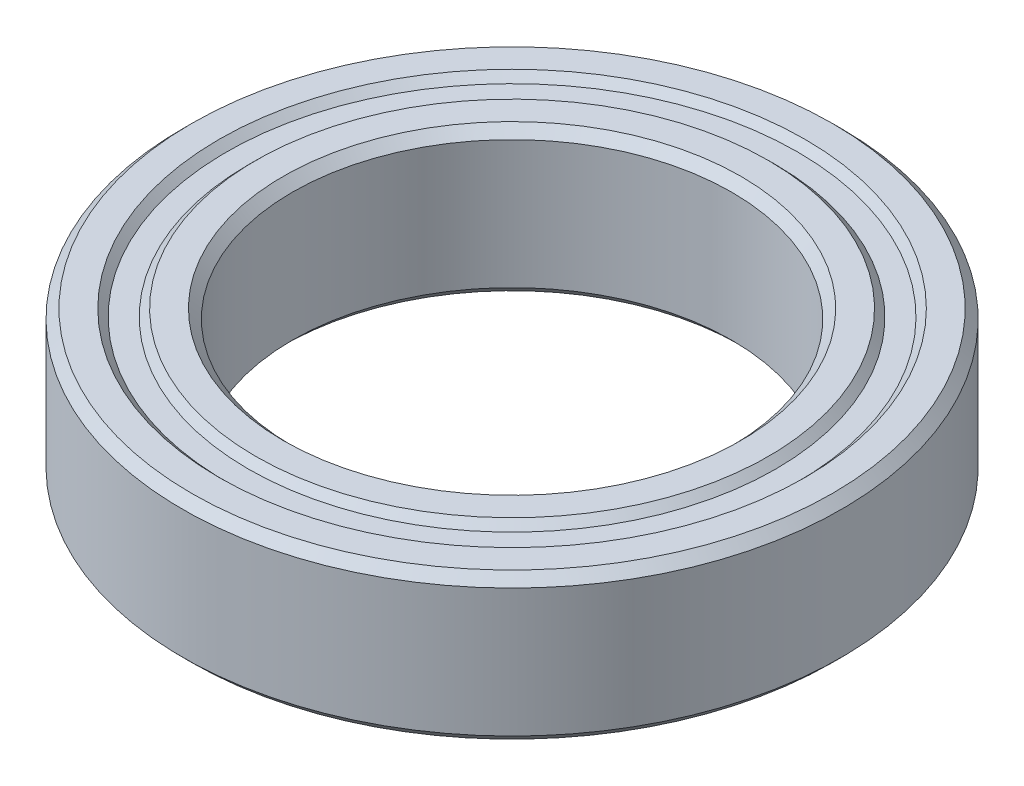
ISO-10303-21;
HEADER;
FILE_DESCRIPTION(('STEP AP214'),'2;1');
FILE_NAME('part.step','',(''),(''),'','','');
FILE_SCHEMA(('AUTOMOTIVE_DESIGN { 1 0 10303 214 1 1 1 1 }'));
ENDSEC;
DATA;
#1=APPLICATION_CONTEXT('core data for automotive mechanical design processes');
#2=APPLICATION_PROTOCOL_DEFINITION('international standard','automotive_design',2000,#1);
#3=PRODUCT_CONTEXT('',#1,'mechanical');
#4=PRODUCT('Part','Part','',(#3));
#5=PRODUCT_RELATED_PRODUCT_CATEGORY('part','',(#4));
#6=PRODUCT_DEFINITION_FORMATION('','',#4);
#7=PRODUCT_DEFINITION_CONTEXT('part definition',#1,'design');
#8=PRODUCT_DEFINITION('design','',#6,#7);
#9=PRODUCT_DEFINITION_SHAPE('','',#8);
#10=(LENGTH_UNIT() NAMED_UNIT(*) SI_UNIT(.MILLI.,.METRE.));
#11=(NAMED_UNIT(*) PLANE_ANGLE_UNIT() SI_UNIT($,.RADIAN.));
#12=(NAMED_UNIT(*) SI_UNIT($,.STERADIAN.) SOLID_ANGLE_UNIT());
#13=UNCERTAINTY_MEASURE_WITH_UNIT(LENGTH_MEASURE(1.E-05),#10,'distance_accuracy_value','');
#14=(GEOMETRIC_REPRESENTATION_CONTEXT(3) GLOBAL_UNCERTAINTY_ASSIGNED_CONTEXT((#13)) GLOBAL_UNIT_ASSIGNED_CONTEXT((#10,
#11,#12)) REPRESENTATION_CONTEXT('',''));
#15=CARTESIAN_POINT('',(0.,0.,0.));
#16=DIRECTION('',(0.,0.,1.));
#17=DIRECTION('',(1.,0.,0.));
#18=AXIS2_PLACEMENT_3D('',#15,#16,#17);
#19=CARTESIAN_POINT('',(0.,2.,0.));
#20=DIRECTION('',(0.,1.,0.));
#21=DIRECTION('',(0.,0.,1.));
#22=AXIS2_PLACEMENT_3D('',#19,#20,#21);
#23=CONICAL_SURFACE('',#22,6.25,0.785398163397447);
#24=CARTESIAN_POINT('',(0.,1.75,0.));
#25=DIRECTION('',(0.,-1.,0.));
#26=DIRECTION('',(0.,0.,-1.));
#27=AXIS2_PLACEMENT_3D('',#24,#25,#26);
#28=CIRCLE('',#27,6.);
#29=CARTESIAN_POINT('',(0.,1.75,-6.));
#30=VERTEX_POINT('',#29);
#31=EDGE_CURVE('E10',#30,#30,#28,.T.);
#32=ORIENTED_EDGE('',*,*,#31,.T.);
#33=EDGE_LOOP('',(#32));
#34=FACE_BOUND('',#33,.T.);
#35=CARTESIAN_POINT('',(0.,2.,0.));
#36=DIRECTION('',(0.,-1.,0.));
#37=DIRECTION('',(0.,0.,-1.));
#38=AXIS2_PLACEMENT_3D('',#35,#36,#37);
#39=CIRCLE('',#38,6.25);
#40=CARTESIAN_POINT('',(0.,2.,-6.25));
#41=VERTEX_POINT('',#40);
#42=EDGE_CURVE('E86',#41,#41,#39,.T.);
#43=ORIENTED_EDGE('',*,*,#42,.F.);
#44=EDGE_LOOP('',(#43));
#45=FACE_BOUND('',#44,.T.);
#46=ADVANCED_FACE('F34',(#34,#45),#23,.F.);
#47=CARTESIAN_POINT('',(0.,-1.34942197217015,0.));
#48=DIRECTION('',(0.,-1.,0.));
#49=DIRECTION('',(0.,0.,-1.));
#50=AXIS2_PLACEMENT_3D('',#47,#48,#49);
#51=CYLINDRICAL_SURFACE('',#50,6.);
#52=CARTESIAN_POINT('',(0.,-1.75,0.));
#53=DIRECTION('',(0.,-1.,0.));
#54=DIRECTION('',(0.,0.,-1.));
#55=AXIS2_PLACEMENT_3D('',#52,#53,#54);
#56=CIRCLE('',#55,6.);
#57=CARTESIAN_POINT('',(0.,-1.75,-6.));
#58=VERTEX_POINT('',#57);
#59=EDGE_CURVE('E40',#58,#58,#56,.T.);
#60=ORIENTED_EDGE('',*,*,#59,.T.);
#61=EDGE_LOOP('',(#60));
#62=FACE_BOUND('',#61,.T.);
#63=ORIENTED_EDGE('',*,*,#31,.F.);
#64=EDGE_LOOP('',(#63));
#65=FACE_BOUND('',#64,.T.);
#66=ADVANCED_FACE('F94',(#62,#65),#51,.F.);
#67=CARTESIAN_POINT('',(0.,-1.75,0.));
#68=DIRECTION('',(0.,-1.,0.));
#69=DIRECTION('',(0.,0.,-1.));
#70=AXIS2_PLACEMENT_3D('',#67,#68,#69);
#71=CONICAL_SURFACE('',#70,6.,0.785398163397447);
#72=CARTESIAN_POINT('',(0.,-2.,0.));
#73=DIRECTION('',(0.,-1.,0.));
#74=DIRECTION('',(0.,0.,-1.));
#75=AXIS2_PLACEMENT_3D('',#72,#73,#74);
#76=CIRCLE('',#75,6.25);
#77=CARTESIAN_POINT('',(0.,-2.,-6.25));
#78=VERTEX_POINT('',#77);
#79=EDGE_CURVE('E44',#78,#78,#76,.T.);
#80=ORIENTED_EDGE('',*,*,#79,.T.);
#81=EDGE_LOOP('',(#80));
#82=FACE_BOUND('',#81,.T.);
#83=ORIENTED_EDGE('',*,*,#59,.F.);
#84=EDGE_LOOP('',(#83));
#85=FACE_BOUND('',#84,.T.);
#86=ADVANCED_FACE('F98',(#82,#85),#71,.F.);
#87=CARTESIAN_POINT('',(6.25,-2.,0.));
#88=DIRECTION('',(0.,-1.,0.));
#89=DIRECTION('',(0.,0.,-1.));
#90=AXIS2_PLACEMENT_3D('',#87,#88,#89);
#91=PLANE('',#90);
#92=CARTESIAN_POINT('',(0.,-2.,0.));
#93=DIRECTION('',(0.,-1.,0.));
#94=DIRECTION('',(0.,0.,-1.));
#95=AXIS2_PLACEMENT_3D('',#92,#93,#94);
#96=CIRCLE('',#95,7.);
#97=CARTESIAN_POINT('',(0.,-2.,-7.));
#98=VERTEX_POINT('',#97);
#99=EDGE_CURVE('E48',#98,#98,#96,.T.);
#100=ORIENTED_EDGE('',*,*,#99,.T.);
#101=EDGE_LOOP('',(#100));
#102=FACE_BOUND('',#101,.T.);
#103=ORIENTED_EDGE('',*,*,#79,.F.);
#104=EDGE_LOOP('',(#103));
#105=FACE_BOUND('',#104,.T.);
#106=ADVANCED_FACE('F102',(#102,#105),#91,.T.);
#107=CARTESIAN_POINT('',(0.,-2.,0.));
#108=DIRECTION('',(0.,1.,0.));
#109=DIRECTION('',(0.,0.,1.));
#110=AXIS2_PLACEMENT_3D('',#107,#108,#109);
#111=CONICAL_SURFACE('',#110,7.,0.78539816339745);
#112=CARTESIAN_POINT('',(0.,-1.8,0.));
#113=DIRECTION('',(0.,-1.,0.));
#114=DIRECTION('',(0.,0.,-1.));
#115=AXIS2_PLACEMENT_3D('',#112,#113,#114);
#116=CIRCLE('',#115,7.2);
#117=CARTESIAN_POINT('',(0.,-1.8,-7.2));
#118=VERTEX_POINT('',#117);
#119=EDGE_CURVE('E53',#118,#118,#116,.T.);
#120=ORIENTED_EDGE('',*,*,#119,.T.);
#121=EDGE_LOOP('',(#120));
#122=FACE_BOUND('',#121,.T.);
#123=ORIENTED_EDGE('',*,*,#99,.F.);
#124=EDGE_LOOP('',(#123));
#125=FACE_BOUND('',#124,.T.);
#126=ADVANCED_FACE('F109',(#122,#125),#111,.T.);
#127=CARTESIAN_POINT('',(7.2,-1.8,0.));
#128=DIRECTION('',(0.,-1.,0.));
#129=DIRECTION('',(0.,0.,-1.));
#130=AXIS2_PLACEMENT_3D('',#127,#128,#129);
#131=PLANE('',#130);
#132=CARTESIAN_POINT('',(0.,-1.8,0.));
#133=DIRECTION('',(0.,-1.,0.));
#134=DIRECTION('',(0.,0.,-1.));
#135=AXIS2_PLACEMENT_3D('',#132,#133,#134);
#136=CIRCLE('',#135,7.8);
#137=CARTESIAN_POINT('',(0.,-1.8,-7.8));
#138=VERTEX_POINT('',#137);
#139=EDGE_CURVE('E56',#138,#138,#136,.T.);
#140=ORIENTED_EDGE('',*,*,#139,.T.);
#141=EDGE_LOOP('',(#140));
#142=FACE_BOUND('',#141,.T.);
#143=ORIENTED_EDGE('',*,*,#119,.F.);
#144=EDGE_LOOP('',(#143));
#145=FACE_BOUND('',#144,.T.);
#146=ADVANCED_FACE('F113',(#142,#145),#131,.T.);
#147=CARTESIAN_POINT('',(0.,-1.8,0.));
#148=DIRECTION('',(0.,-1.,0.));
#149=DIRECTION('',(0.,0.,-1.));
#150=AXIS2_PLACEMENT_3D('',#147,#148,#149);
#151=CONICAL_SURFACE('',#150,7.8,0.78539816339745);
#152=CARTESIAN_POINT('',(0.,-2.,0.));
#153=DIRECTION('',(0.,-1.,0.));
#154=DIRECTION('',(0.,0.,-1.));
#155=AXIS2_PLACEMENT_3D('',#152,#153,#154);
#156=CIRCLE('',#155,8.);
#157=CARTESIAN_POINT('',(0.,-2.,-8.));
#158=VERTEX_POINT('',#157);
#159=EDGE_CURVE('E59',#158,#158,#156,.T.);
#160=ORIENTED_EDGE('',*,*,#159,.T.);
#161=EDGE_LOOP('',(#160));
#162=FACE_BOUND('',#161,.T.);
#163=ORIENTED_EDGE('',*,*,#139,.F.);
#164=EDGE_LOOP('',(#163));
#165=FACE_BOUND('',#164,.T.);
#166=ADVANCED_FACE('F117',(#162,#165),#151,.F.);
#167=CARTESIAN_POINT('',(8.,-2.,0.));
#168=DIRECTION('',(0.,-1.,0.));
#169=DIRECTION('',(0.,0.,-1.));
#170=AXIS2_PLACEMENT_3D('',#167,#168,#169);
#171=PLANE('',#170);
#172=CARTESIAN_POINT('',(0.,-2.,0.));
#173=DIRECTION('',(0.,-1.,0.));
#174=DIRECTION('',(0.,0.,-1.));
#175=AXIS2_PLACEMENT_3D('',#172,#173,#174);
#176=CIRCLE('',#175,8.75);
#177=CARTESIAN_POINT('',(0.,-2.,-8.75));
#178=VERTEX_POINT('',#177);
#179=EDGE_CURVE('E62',#178,#178,#176,.T.);
#180=ORIENTED_EDGE('',*,*,#179,.T.);
#181=EDGE_LOOP('',(#180));
#182=FACE_BOUND('',#181,.T.);
#183=ORIENTED_EDGE('',*,*,#159,.F.);
#184=EDGE_LOOP('',(#183));
#185=FACE_BOUND('',#184,.T.);
#186=ADVANCED_FACE('F121',(#182,#185),#171,.T.);
#187=CARTESIAN_POINT('',(0.,-2.,0.));
#188=DIRECTION('',(0.,1.,0.));
#189=DIRECTION('',(0.,0.,1.));
#190=AXIS2_PLACEMENT_3D('',#187,#188,#189);
#191=CONICAL_SURFACE('',#190,8.75,0.785398163397449);
#192=CARTESIAN_POINT('',(0.,-1.75,0.));
#193=DIRECTION('',(0.,-1.,0.));
#194=DIRECTION('',(0.,0.,-1.));
#195=AXIS2_PLACEMENT_3D('',#192,#193,#194);
#196=CIRCLE('',#195,9.);
#197=CARTESIAN_POINT('',(0.,-1.75,-9.));
#198=VERTEX_POINT('',#197);
#199=EDGE_CURVE('E65',#198,#198,#196,.T.);
#200=ORIENTED_EDGE('',*,*,#199,.T.);
#201=EDGE_LOOP('',(#200));
#202=FACE_BOUND('',#201,.T.);
#203=ORIENTED_EDGE('',*,*,#179,.F.);
#204=EDGE_LOOP('',(#203));
#205=FACE_BOUND('',#204,.T.);
#206=ADVANCED_FACE('F125',(#202,#205),#191,.T.);
#207=CARTESIAN_POINT('',(0.,-1.34942197217015,0.));
#208=DIRECTION('',(0.,-1.,0.));
#209=DIRECTION('',(0.,0.,-1.));
#210=AXIS2_PLACEMENT_3D('',#207,#208,#209);
#211=CYLINDRICAL_SURFACE('',#210,9.);
#212=CARTESIAN_POINT('',(0.,1.75,0.));
#213=DIRECTION('',(0.,-1.,0.));
#214=DIRECTION('',(0.,0.,-1.));
#215=AXIS2_PLACEMENT_3D('',#212,#213,#214);
#216=CIRCLE('',#215,9.);
#217=CARTESIAN_POINT('',(0.,1.75,-9.));
#218=VERTEX_POINT('',#217);
#219=EDGE_CURVE('E68',#218,#218,#216,.T.);
#220=ORIENTED_EDGE('',*,*,#219,.T.);
#221=EDGE_LOOP('',(#220));
#222=FACE_BOUND('',#221,.T.);
#223=ORIENTED_EDGE('',*,*,#199,.F.);
#224=EDGE_LOOP('',(#223));
#225=FACE_BOUND('',#224,.T.);
#226=ADVANCED_FACE('F129',(#222,#225),#211,.T.);
#227=CARTESIAN_POINT('',(0.,1.75,0.));
#228=DIRECTION('',(0.,-1.,0.));
#229=DIRECTION('',(0.,0.,-1.));
#230=AXIS2_PLACEMENT_3D('',#227,#228,#229);
#231=CONICAL_SURFACE('',#230,9.,0.785398163397456);
#232=CARTESIAN_POINT('',(0.,2.,0.));
#233=DIRECTION('',(0.,-1.,0.));
#234=DIRECTION('',(0.,0.,-1.));
#235=AXIS2_PLACEMENT_3D('',#232,#233,#234);
#236=CIRCLE('',#235,8.75);
#237=CARTESIAN_POINT('',(0.,2.,-8.75));
#238=VERTEX_POINT('',#237);
#239=EDGE_CURVE('E71',#238,#238,#236,.T.);
#240=ORIENTED_EDGE('',*,*,#239,.T.);
#241=EDGE_LOOP('',(#240));
#242=FACE_BOUND('',#241,.T.);
#243=ORIENTED_EDGE('',*,*,#219,.F.);
#244=EDGE_LOOP('',(#243));
#245=FACE_BOUND('',#244,.T.);
#246=ADVANCED_FACE('F133',(#242,#245),#231,.T.);
#247=CARTESIAN_POINT('',(8.75,2.,0.));
#248=DIRECTION('',(0.,1.,0.));
#249=DIRECTION('',(0.,0.,1.));
#250=AXIS2_PLACEMENT_3D('',#247,#248,#249);
#251=PLANE('',#250);
#252=CARTESIAN_POINT('',(0.,2.,0.));
#253=DIRECTION('',(0.,-1.,0.));
#254=DIRECTION('',(0.,0.,-1.));
#255=AXIS2_PLACEMENT_3D('',#252,#253,#254);
#256=CIRCLE('',#255,8.);
#257=CARTESIAN_POINT('',(0.,2.,-8.));
#258=VERTEX_POINT('',#257);
#259=EDGE_CURVE('E74',#258,#258,#256,.T.);
#260=ORIENTED_EDGE('',*,*,#259,.T.);
#261=EDGE_LOOP('',(#260));
#262=FACE_BOUND('',#261,.T.);
#263=ORIENTED_EDGE('',*,*,#239,.F.);
#264=EDGE_LOOP('',(#263));
#265=FACE_BOUND('',#264,.T.);
#266=ADVANCED_FACE('F137',(#262,#265),#251,.T.);
#267=CARTESIAN_POINT('',(0.,2.,0.));
#268=DIRECTION('',(0.,1.,0.));
#269=DIRECTION('',(0.,0.,1.));
#270=AXIS2_PLACEMENT_3D('',#267,#268,#269);
#271=CONICAL_SURFACE('',#270,8.,0.785398163397442);
#272=CARTESIAN_POINT('',(0.,1.8,0.));
#273=DIRECTION('',(0.,-1.,0.));
#274=DIRECTION('',(0.,0.,-1.));
#275=AXIS2_PLACEMENT_3D('',#272,#273,#274);
#276=CIRCLE('',#275,7.8);
#277=CARTESIAN_POINT('',(0.,1.8,-7.8));
#278=VERTEX_POINT('',#277);
#279=EDGE_CURVE('E77',#278,#278,#276,.T.);
#280=ORIENTED_EDGE('',*,*,#279,.T.);
#281=EDGE_LOOP('',(#280));
#282=FACE_BOUND('',#281,.T.);
#283=ORIENTED_EDGE('',*,*,#259,.F.);
#284=EDGE_LOOP('',(#283));
#285=FACE_BOUND('',#284,.T.);
#286=ADVANCED_FACE('F141',(#282,#285),#271,.F.);
#287=CARTESIAN_POINT('',(7.8,1.8,0.));
#288=DIRECTION('',(0.,1.,0.));
#289=DIRECTION('',(0.,0.,1.));
#290=AXIS2_PLACEMENT_3D('',#287,#288,#289);
#291=PLANE('',#290);
#292=CARTESIAN_POINT('',(0.,1.8,0.));
#293=DIRECTION('',(0.,-1.,0.));
#294=DIRECTION('',(0.,0.,-1.));
#295=AXIS2_PLACEMENT_3D('',#292,#293,#294);
#296=CIRCLE('',#295,7.2);
#297=CARTESIAN_POINT('',(0.,1.8,-7.2));
#298=VERTEX_POINT('',#297);
#299=EDGE_CURVE('E80',#298,#298,#296,.T.);
#300=ORIENTED_EDGE('',*,*,#299,.T.);
#301=EDGE_LOOP('',(#300));
#302=FACE_BOUND('',#301,.T.);
#303=ORIENTED_EDGE('',*,*,#279,.F.);
#304=EDGE_LOOP('',(#303));
#305=FACE_BOUND('',#304,.T.);
#306=ADVANCED_FACE('F145',(#302,#305),#291,.T.);
#307=CARTESIAN_POINT('',(0.,1.8,0.));
#308=DIRECTION('',(0.,-1.,0.));
#309=DIRECTION('',(0.,0.,-1.));
#310=AXIS2_PLACEMENT_3D('',#307,#308,#309);
#311=CONICAL_SURFACE('',#310,7.2,0.785398163397447);
#312=CARTESIAN_POINT('',(0.,2.,0.));
#313=DIRECTION('',(0.,-1.,0.));
#314=DIRECTION('',(0.,0.,-1.));
#315=AXIS2_PLACEMENT_3D('',#312,#313,#314);
#316=CIRCLE('',#315,7.);
#317=CARTESIAN_POINT('',(0.,2.,-7.));
#318=VERTEX_POINT('',#317);
#319=EDGE_CURVE('E83',#318,#318,#316,.T.);
#320=ORIENTED_EDGE('',*,*,#319,.T.);
#321=EDGE_LOOP('',(#320));
#322=FACE_BOUND('',#321,.T.);
#323=ORIENTED_EDGE('',*,*,#299,.F.);
#324=EDGE_LOOP('',(#323));
#325=FACE_BOUND('',#324,.T.);
#326=ADVANCED_FACE('F149',(#322,#325),#311,.T.);
#327=CARTESIAN_POINT('',(7.,2.,0.));
#328=DIRECTION('',(0.,1.,0.));
#329=DIRECTION('',(0.,0.,1.));
#330=AXIS2_PLACEMENT_3D('',#327,#328,#329);
#331=PLANE('',#330);
#332=ORIENTED_EDGE('',*,*,#42,.T.);
#333=EDGE_LOOP('',(#332));
#334=FACE_BOUND('',#333,.T.);
#335=ORIENTED_EDGE('',*,*,#319,.F.);
#336=EDGE_LOOP('',(#335));
#337=FACE_BOUND('',#336,.T.);
#338=ADVANCED_FACE('F90',(#334,#337),#331,.T.);
#339=CLOSED_SHELL('',(#46,#66,#86,#106,#126,#146,#166,#186,#206,#226,#246,#266,#286,#306,#326,#338));
#340=MANIFOLD_SOLID_BREP('B2',#339);
#341=ADVANCED_BREP_SHAPE_REPRESENTATION('',(#18,#340),#14);
#342=SHAPE_DEFINITION_REPRESENTATION(#9,#341);
ENDSEC;
END-ISO-10303-21;
